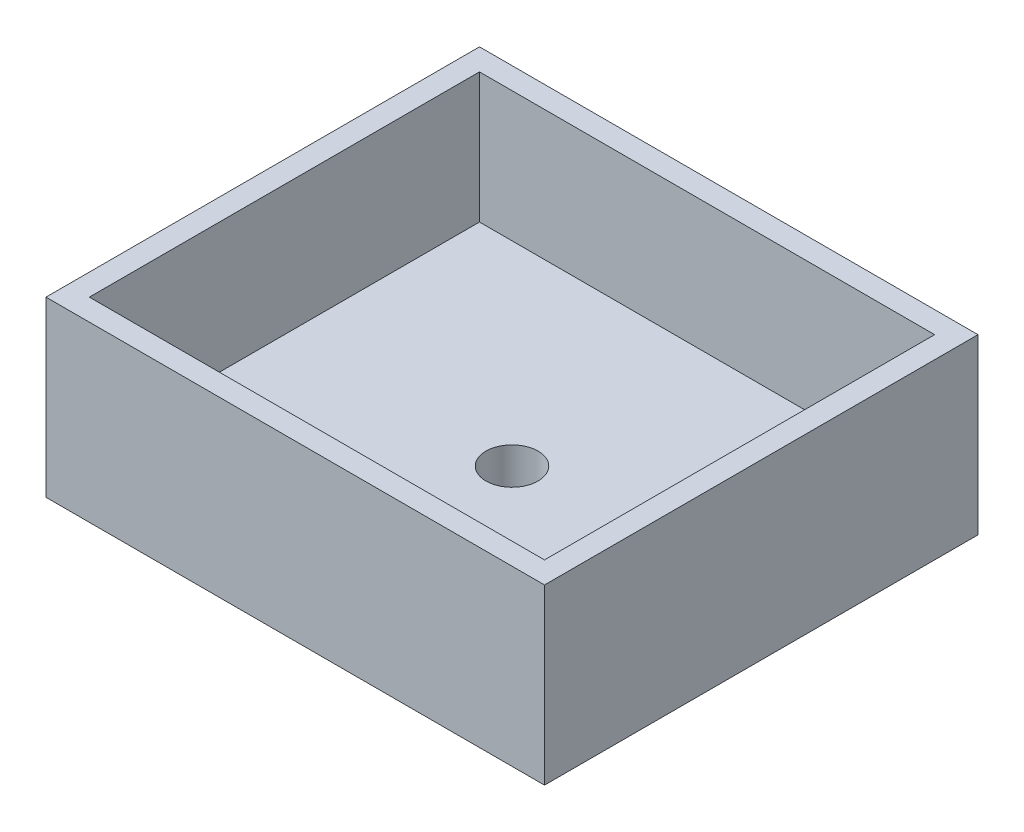
ISO-10303-21;
HEADER;
FILE_DESCRIPTION(('STEP AP214'),'2;1');
FILE_NAME('part.step','',(''),(''),'','','');
FILE_SCHEMA(('AUTOMOTIVE_DESIGN { 1 0 10303 214 1 1 1 1 }'));
ENDSEC;
DATA;
#1=APPLICATION_CONTEXT('core data for automotive mechanical design processes');
#2=APPLICATION_PROTOCOL_DEFINITION('international standard','automotive_design',2000,#1);
#3=PRODUCT_CONTEXT('',#1,'mechanical');
#4=PRODUCT('Part','Part','',(#3));
#5=PRODUCT_RELATED_PRODUCT_CATEGORY('part','',(#4));
#6=PRODUCT_DEFINITION_FORMATION('','',#4);
#7=PRODUCT_DEFINITION_CONTEXT('part definition',#1,'design');
#8=PRODUCT_DEFINITION('design','',#6,#7);
#9=PRODUCT_DEFINITION_SHAPE('','',#8);
#10=(LENGTH_UNIT() NAMED_UNIT(*) SI_UNIT(.MILLI.,.METRE.));
#11=(NAMED_UNIT(*) PLANE_ANGLE_UNIT() SI_UNIT($,.RADIAN.));
#12=(NAMED_UNIT(*) SI_UNIT($,.STERADIAN.) SOLID_ANGLE_UNIT());
#13=UNCERTAINTY_MEASURE_WITH_UNIT(LENGTH_MEASURE(1.E-05),#10,'distance_accuracy_value','');
#14=(GEOMETRIC_REPRESENTATION_CONTEXT(3) GLOBAL_UNCERTAINTY_ASSIGNED_CONTEXT((#13)) GLOBAL_UNIT_ASSIGNED_CONTEXT((#10,
#11,#12)) REPRESENTATION_CONTEXT('',''));
#15=CARTESIAN_POINT('',(0.,0.,0.));
#16=DIRECTION('',(0.,0.,1.));
#17=DIRECTION('',(1.,0.,0.));
#18=AXIS2_PLACEMENT_3D('',#15,#16,#17);
#19=CARTESIAN_POINT('',(0.,1.,0.));
#20=DIRECTION('',(0.,1.,0.));
#21=DIRECTION('',(0.,0.,1.));
#22=AXIS2_PLACEMENT_3D('',#19,#20,#21);
#23=PLANE('',#22);
#24=CARTESIAN_POINT('',(5.75,1.,-5.));
#25=DIRECTION('',(0.,1.,0.));
#26=DIRECTION('',(0.,0.,1.));
#27=AXIS2_PLACEMENT_3D('',#24,#25,#26);
#28=CIRCLE('',#27,0.6);
#29=CARTESIAN_POINT('',(5.75,1.,-4.4));
#30=VERTEX_POINT('',#29);
#31=EDGE_CURVE('E283',#30,#30,#28,.T.);
#32=ORIENTED_EDGE('',*,*,#31,.F.);
#33=EDGE_LOOP('',(#32));
#34=FACE_BOUND('',#33,.T.);
#35=DIRECTION('',(1.,0.,0.));
#36=VECTOR('',#35,1.);
#37=CARTESIAN_POINT('',(0.,1.,-0.499999999999999));
#38=LINE('',#37,#36);
#39=CARTESIAN_POINT('',(0.500000000000001,1.,-0.499999999999999));
#40=VERTEX_POINT('',#39);
#41=CARTESIAN_POINT('',(11.,1.,-0.499999999999999));
#42=VERTEX_POINT('',#41);
#43=EDGE_CURVE('E190',#40,#42,#38,.T.);
#44=ORIENTED_EDGE('',*,*,#43,.T.);
#45=DIRECTION('',(0.,0.,-1.));
#46=VECTOR('',#45,1.);
#47=CARTESIAN_POINT('',(11.,1.,0.));
#48=LINE('',#47,#46);
#49=CARTESIAN_POINT('',(11.,1.,-9.5));
#50=VERTEX_POINT('',#49);
#51=EDGE_CURVE('E194',#42,#50,#48,.T.);
#52=ORIENTED_EDGE('',*,*,#51,.T.);
#53=DIRECTION('',(1.,0.,0.));
#54=VECTOR('',#53,1.);
#55=CARTESIAN_POINT('',(0.,1.,-9.5));
#56=LINE('',#55,#54);
#57=CARTESIAN_POINT('',(0.500000000000001,1.,-9.5));
#58=VERTEX_POINT('',#57);
#59=EDGE_CURVE('E56',#58,#50,#56,.T.);
#60=ORIENTED_EDGE('',*,*,#59,.F.);
#61=DIRECTION('',(0.,0.,-1.));
#62=VECTOR('',#61,1.);
#63=CARTESIAN_POINT('',(0.500000000000001,1.,0.));
#64=LINE('',#63,#62);
#65=EDGE_CURVE('E11',#40,#58,#64,.T.);
#66=ORIENTED_EDGE('',*,*,#65,.F.);
#67=EDGE_LOOP('',(#44,#52,#60,#66));
#68=FACE_BOUND('',#67,.T.);
#69=ADVANCED_FACE('F46',(#34,#68),#23,.T.);
#70=CARTESIAN_POINT('',(0.,4.,0.));
#71=DIRECTION('',(0.,1.,0.));
#72=DIRECTION('',(0.,0.,1.));
#73=AXIS2_PLACEMENT_3D('',#70,#71,#72);
#74=PLANE('',#73);
#75=DIRECTION('',(0.,0.,1.));
#76=VECTOR('',#75,1.);
#77=CARTESIAN_POINT('',(0.,4.,-10.));
#78=LINE('',#77,#76);
#79=CARTESIAN_POINT('',(0.,4.,-10.));
#80=VERTEX_POINT('',#79);
#81=CARTESIAN_POINT('',(0.,4.,0.));
#82=VERTEX_POINT('',#81);
#83=EDGE_CURVE('E149',#80,#82,#78,.T.);
#84=ORIENTED_EDGE('',*,*,#83,.T.);
#85=DIRECTION('',(1.,0.,0.));
#86=VECTOR('',#85,1.);
#87=CARTESIAN_POINT('',(0.,4.,0.));
#88=LINE('',#87,#86);
#89=CARTESIAN_POINT('',(11.5,4.,0.));
#90=VERTEX_POINT('',#89);
#91=EDGE_CURVE('E153',#82,#90,#88,.T.);
#92=ORIENTED_EDGE('',*,*,#91,.T.);
#93=DIRECTION('',(0.,0.,-1.));
#94=VECTOR('',#93,1.);
#95=CARTESIAN_POINT('',(11.5,4.,0.));
#96=LINE('',#95,#94);
#97=CARTESIAN_POINT('',(11.5,4.,-10.));
#98=VERTEX_POINT('',#97);
#99=EDGE_CURVE('E157',#90,#98,#96,.T.);
#100=ORIENTED_EDGE('',*,*,#99,.T.);
#101=DIRECTION('',(-1.,0.,0.));
#102=VECTOR('',#101,1.);
#103=CARTESIAN_POINT('',(11.5,4.,-10.));
#104=LINE('',#103,#102);
#105=EDGE_CURVE('E160',#98,#80,#104,.T.);
#106=ORIENTED_EDGE('',*,*,#105,.T.);
#107=EDGE_LOOP('',(#84,#92,#100,#106));
#108=FACE_BOUND('',#107,.T.);
#109=DIRECTION('',(-1.,0.,0.));
#110=VECTOR('',#109,1.);
#111=CARTESIAN_POINT('',(0.500000000000001,4.,-9.5));
#112=LINE('',#111,#110);
#113=CARTESIAN_POINT('',(11.,4.,-9.5));
#114=VERTEX_POINT('',#113);
#115=CARTESIAN_POINT('',(0.500000000000001,4.,-9.5));
#116=VERTEX_POINT('',#115);
#117=EDGE_CURVE('E120',#114,#116,#112,.T.);
#118=ORIENTED_EDGE('',*,*,#117,.F.);
#119=DIRECTION('',(0.,0.,-1.));
#120=VECTOR('',#119,1.);
#121=CARTESIAN_POINT('',(11.,4.,-0.499999999999999));
#122=LINE('',#121,#120);
#123=CARTESIAN_POINT('',(11.,4.,-0.499999999999999));
#124=VERTEX_POINT('',#123);
#125=EDGE_CURVE('E112',#124,#114,#122,.T.);
#126=ORIENTED_EDGE('',*,*,#125,.F.);
#127=DIRECTION('',(1.,0.,0.));
#128=VECTOR('',#127,1.);
#129=CARTESIAN_POINT('',(0.500000000000001,4.,-0.499999999999999));
#130=LINE('',#129,#128);
#131=CARTESIAN_POINT('',(0.500000000000001,4.,-0.499999999999999));
#132=VERTEX_POINT('',#131);
#133=EDGE_CURVE('E135',#132,#124,#130,.T.);
#134=ORIENTED_EDGE('',*,*,#133,.F.);
#135=DIRECTION('',(0.,0.,1.));
#136=VECTOR('',#135,1.);
#137=CARTESIAN_POINT('',(0.500000000000001,4.,-0.499999999999999));
#138=LINE('',#137,#136);
#139=EDGE_CURVE('E131',#116,#132,#138,.T.);
#140=ORIENTED_EDGE('',*,*,#139,.F.);
#141=EDGE_LOOP('',(#118,#126,#134,#140));
#142=FACE_BOUND('',#141,.T.);
#143=ADVANCED_FACE('F129',(#108,#142),#74,.T.);
#144=CARTESIAN_POINT('',(0.,4.,-10.));
#145=DIRECTION('',(1.,0.,0.));
#146=DIRECTION('',(0.,0.,-1.));
#147=AXIS2_PLACEMENT_3D('',#144,#145,#146);
#148=PLANE('',#147);
#149=DIRECTION('',(0.,0.,1.));
#150=VECTOR('',#149,1.);
#151=CARTESIAN_POINT('',(0.,0.,-10.));
#152=LINE('',#151,#150);
#153=CARTESIAN_POINT('',(0.,0.,-10.));
#154=VERTEX_POINT('',#153);
#155=CARTESIAN_POINT('',(0.,0.,0.));
#156=VERTEX_POINT('',#155);
#157=EDGE_CURVE('E125',#154,#156,#152,.T.);
#158=ORIENTED_EDGE('',*,*,#157,.T.);
#159=DIRECTION('',(0.,-1.,0.));
#160=VECTOR('',#159,1.);
#161=CARTESIAN_POINT('',(0.,4.,0.));
#162=LINE('',#161,#160);
#163=EDGE_CURVE('E186',#82,#156,#162,.T.);
#164=ORIENTED_EDGE('',*,*,#163,.F.);
#165=ORIENTED_EDGE('',*,*,#83,.F.);
#166=DIRECTION('',(0.,-1.,0.));
#167=VECTOR('',#166,1.);
#168=CARTESIAN_POINT('',(0.,4.,-10.));
#169=LINE('',#168,#167);
#170=EDGE_CURVE('E163',#80,#154,#169,.T.);
#171=ORIENTED_EDGE('',*,*,#170,.T.);
#172=EDGE_LOOP('',(#158,#164,#165,#171));
#173=FACE_BOUND('',#172,.T.);
#174=ADVANCED_FACE('F217',(#173),#148,.F.);
#175=CARTESIAN_POINT('',(0.,4.,0.));
#176=DIRECTION('',(0.,0.,-1.));
#177=DIRECTION('',(-1.,0.,0.));
#178=AXIS2_PLACEMENT_3D('',#175,#176,#177);
#179=PLANE('',#178);
#180=DIRECTION('',(1.,0.,0.));
#181=VECTOR('',#180,1.);
#182=CARTESIAN_POINT('',(0.,0.,0.));
#183=LINE('',#182,#181);
#184=CARTESIAN_POINT('',(11.5,0.,0.));
#185=VERTEX_POINT('',#184);
#186=EDGE_CURVE('E167',#156,#185,#183,.T.);
#187=ORIENTED_EDGE('',*,*,#186,.T.);
#188=DIRECTION('',(0.,-1.,0.));
#189=VECTOR('',#188,1.);
#190=CARTESIAN_POINT('',(11.5,4.,0.));
#191=LINE('',#190,#189);
#192=EDGE_CURVE('E182',#90,#185,#191,.T.);
#193=ORIENTED_EDGE('',*,*,#192,.F.);
#194=ORIENTED_EDGE('',*,*,#91,.F.);
#195=ORIENTED_EDGE('',*,*,#163,.T.);
#196=EDGE_LOOP('',(#187,#193,#194,#195));
#197=FACE_BOUND('',#196,.T.);
#198=ADVANCED_FACE('F224',(#197),#179,.F.);
#199=CARTESIAN_POINT('',(11.5,4.,0.));
#200=DIRECTION('',(-1.,0.,0.));
#201=DIRECTION('',(0.,0.,1.));
#202=AXIS2_PLACEMENT_3D('',#199,#200,#201);
#203=PLANE('',#202);
#204=DIRECTION('',(0.,0.,-1.));
#205=VECTOR('',#204,1.);
#206=CARTESIAN_POINT('',(11.5,0.,0.));
#207=LINE('',#206,#205);
#208=CARTESIAN_POINT('',(11.5,0.,-10.));
#209=VERTEX_POINT('',#208);
#210=EDGE_CURVE('E170',#185,#209,#207,.T.);
#211=ORIENTED_EDGE('',*,*,#210,.T.);
#212=DIRECTION('',(0.,-1.,0.));
#213=VECTOR('',#212,1.);
#214=CARTESIAN_POINT('',(11.5,4.,-10.));
#215=LINE('',#214,#213);
#216=EDGE_CURVE('E178',#98,#209,#215,.T.);
#217=ORIENTED_EDGE('',*,*,#216,.F.);
#218=ORIENTED_EDGE('',*,*,#99,.F.);
#219=ORIENTED_EDGE('',*,*,#192,.T.);
#220=EDGE_LOOP('',(#211,#217,#218,#219));
#221=FACE_BOUND('',#220,.T.);
#222=ADVANCED_FACE('F228',(#221),#203,.F.);
#223=CARTESIAN_POINT('',(11.5,4.,-10.));
#224=DIRECTION('',(0.,0.,1.));
#225=DIRECTION('',(1.,0.,0.));
#226=AXIS2_PLACEMENT_3D('',#223,#224,#225);
#227=PLANE('',#226);
#228=DIRECTION('',(-1.,0.,0.));
#229=VECTOR('',#228,1.);
#230=CARTESIAN_POINT('',(11.5,0.,-10.));
#231=LINE('',#230,#229);
#232=EDGE_CURVE('E154',#209,#154,#231,.T.);
#233=ORIENTED_EDGE('',*,*,#232,.T.);
#234=ORIENTED_EDGE('',*,*,#170,.F.);
#235=ORIENTED_EDGE('',*,*,#105,.F.);
#236=ORIENTED_EDGE('',*,*,#216,.T.);
#237=EDGE_LOOP('',(#233,#234,#235,#236));
#238=FACE_BOUND('',#237,.T.);
#239=ADVANCED_FACE('F232',(#238),#227,.F.);
#240=CARTESIAN_POINT('',(11.,4.,-0.499999999999999));
#241=DIRECTION('',(-1.,0.,0.));
#242=DIRECTION('',(0.,0.,1.));
#243=AXIS2_PLACEMENT_3D('',#240,#241,#242);
#244=PLANE('',#243);
#245=DIRECTION('',(0.,-1.,0.));
#246=VECTOR('',#245,1.);
#247=CARTESIAN_POINT('',(11.,4.,-9.5));
#248=LINE('',#247,#246);
#249=EDGE_CURVE('E114',#114,#50,#248,.T.);
#250=ORIENTED_EDGE('',*,*,#249,.T.);
#251=ORIENTED_EDGE('',*,*,#51,.F.);
#252=DIRECTION('',(0.,-1.,0.));
#253=VECTOR('',#252,1.);
#254=CARTESIAN_POINT('',(11.,4.,-0.499999999999999));
#255=LINE('',#254,#253);
#256=EDGE_CURVE('E63',#124,#42,#255,.T.);
#257=ORIENTED_EDGE('',*,*,#256,.F.);
#258=ORIENTED_EDGE('',*,*,#125,.T.);
#259=EDGE_LOOP('',(#250,#251,#257,#258));
#260=FACE_BOUND('',#259,.T.);
#261=ADVANCED_FACE('F113',(#260),#244,.T.);
#262=CARTESIAN_POINT('',(0.500000000000001,4.,-9.5));
#263=DIRECTION('',(0.,0.,1.));
#264=DIRECTION('',(1.,0.,0.));
#265=AXIS2_PLACEMENT_3D('',#262,#263,#264);
#266=PLANE('',#265);
#267=DIRECTION('',(0.,-1.,0.));
#268=VECTOR('',#267,1.);
#269=CARTESIAN_POINT('',(0.500000000000001,4.,-9.5));
#270=LINE('',#269,#268);
#271=EDGE_CURVE('E126',#116,#58,#270,.T.);
#272=ORIENTED_EDGE('',*,*,#271,.T.);
#273=ORIENTED_EDGE('',*,*,#59,.T.);
#274=ORIENTED_EDGE('',*,*,#249,.F.);
#275=ORIENTED_EDGE('',*,*,#117,.T.);
#276=EDGE_LOOP('',(#272,#273,#274,#275));
#277=FACE_BOUND('',#276,.T.);
#278=ADVANCED_FACE('F122',(#277),#266,.T.);
#279=CARTESIAN_POINT('',(0.500000000000001,4.,-0.499999999999999));
#280=DIRECTION('',(1.,0.,0.));
#281=DIRECTION('',(0.,0.,-1.));
#282=AXIS2_PLACEMENT_3D('',#279,#280,#281);
#283=PLANE('',#282);
#284=DIRECTION('',(0.,-1.,0.));
#285=VECTOR('',#284,1.);
#286=CARTESIAN_POINT('',(0.500000000000001,4.,-0.499999999999999));
#287=LINE('',#286,#285);
#288=EDGE_CURVE('E143',#132,#40,#287,.T.);
#289=ORIENTED_EDGE('',*,*,#288,.T.);
#290=ORIENTED_EDGE('',*,*,#65,.T.);
#291=ORIENTED_EDGE('',*,*,#271,.F.);
#292=ORIENTED_EDGE('',*,*,#139,.T.);
#293=EDGE_LOOP('',(#289,#290,#291,#292));
#294=FACE_BOUND('',#293,.T.);
#295=ADVANCED_FACE('F202',(#294),#283,.T.);
#296=CARTESIAN_POINT('',(0.500000000000001,4.,-0.499999999999999));
#297=DIRECTION('',(0.,0.,-1.));
#298=DIRECTION('',(-1.,0.,0.));
#299=AXIS2_PLACEMENT_3D('',#296,#297,#298);
#300=PLANE('',#299);
#301=ORIENTED_EDGE('',*,*,#256,.T.);
#302=ORIENTED_EDGE('',*,*,#43,.F.);
#303=ORIENTED_EDGE('',*,*,#288,.F.);
#304=ORIENTED_EDGE('',*,*,#133,.T.);
#305=EDGE_LOOP('',(#301,#302,#303,#304));
#306=FACE_BOUND('',#305,.T.);
#307=ADVANCED_FACE('F200',(#306),#300,.T.);
#308=CARTESIAN_POINT('',(0.,0.,0.));
#309=DIRECTION('',(0.,1.,0.));
#310=DIRECTION('',(0.,0.,1.));
#311=AXIS2_PLACEMENT_3D('',#308,#309,#310);
#312=PLANE('',#311);
#313=CARTESIAN_POINT('',(5.75,0.,-5.));
#314=DIRECTION('',(0.,1.,0.));
#315=DIRECTION('',(0.,0.,1.));
#316=AXIS2_PLACEMENT_3D('',#313,#314,#315);
#317=CIRCLE('',#316,0.6);
#318=CARTESIAN_POINT('',(5.75,0.,-4.4));
#319=VERTEX_POINT('',#318);
#320=EDGE_CURVE('E50',#319,#319,#317,.T.);
#321=ORIENTED_EDGE('',*,*,#320,.T.);
#322=EDGE_LOOP('',(#321));
#323=FACE_BOUND('',#322,.T.);
#324=ORIENTED_EDGE('',*,*,#157,.F.);
#325=ORIENTED_EDGE('',*,*,#232,.F.);
#326=ORIENTED_EDGE('',*,*,#210,.F.);
#327=ORIENTED_EDGE('',*,*,#186,.F.);
#328=EDGE_LOOP('',(#324,#325,#326,#327));
#329=FACE_BOUND('',#328,.T.);
#330=ADVANCED_FACE('F48',(#323,#329),#312,.F.);
#331=CARTESIAN_POINT('',(5.75,-9.,-5.));
#332=DIRECTION('',(0.,1.,0.));
#333=DIRECTION('',(0.,0.,1.));
#334=AXIS2_PLACEMENT_3D('',#331,#332,#333);
#335=CYLINDRICAL_SURFACE('',#334,0.6);
#336=ORIENTED_EDGE('',*,*,#31,.T.);
#337=EDGE_LOOP('',(#336));
#338=FACE_BOUND('',#337,.T.);
#339=ORIENTED_EDGE('',*,*,#320,.F.);
#340=EDGE_LOOP('',(#339));
#341=FACE_BOUND('',#340,.T.);
#342=ADVANCED_FACE('F267',(#338,#341),#335,.F.);
#343=CLOSED_SHELL('',(#69,#143,#174,#198,#222,#239,#261,#278,#295,#307,#330,#342));
#344=MANIFOLD_SOLID_BREP('B2',#343);
#345=ADVANCED_BREP_SHAPE_REPRESENTATION('',(#18,#344),#14);
#346=SHAPE_DEFINITION_REPRESENTATION(#9,#345);
ENDSEC;
END-ISO-10303-21;
